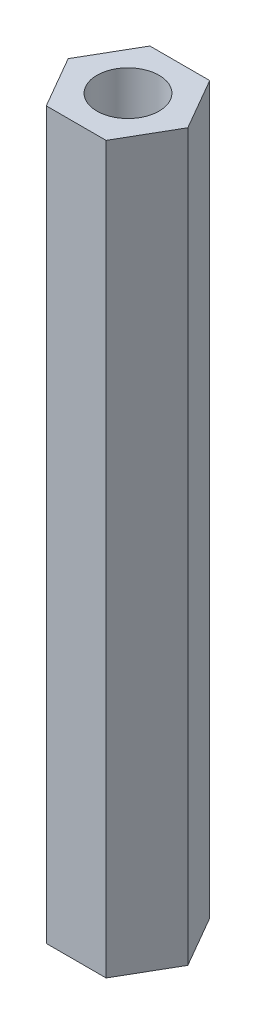
ISO-10303-21;
HEADER;
FILE_DESCRIPTION(('STEP AP214'),'2;1');
FILE_NAME('part.step','',(''),(''),'','','');
FILE_SCHEMA(('AUTOMOTIVE_DESIGN { 1 0 10303 214 1 1 1 1 }'));
ENDSEC;
DATA;
#1=APPLICATION_CONTEXT('core data for automotive mechanical design processes');
#2=APPLICATION_PROTOCOL_DEFINITION('international standard','automotive_design',2000,#1);
#3=PRODUCT_CONTEXT('',#1,'mechanical');
#4=PRODUCT('Part','Part','',(#3));
#5=PRODUCT_RELATED_PRODUCT_CATEGORY('part','',(#4));
#6=PRODUCT_DEFINITION_FORMATION('','',#4);
#7=PRODUCT_DEFINITION_CONTEXT('part definition',#1,'design');
#8=PRODUCT_DEFINITION('design','',#6,#7);
#9=PRODUCT_DEFINITION_SHAPE('','',#8);
#10=(LENGTH_UNIT() NAMED_UNIT(*) SI_UNIT(.MILLI.,.METRE.));
#11=(NAMED_UNIT(*) PLANE_ANGLE_UNIT() SI_UNIT($,.RADIAN.));
#12=(NAMED_UNIT(*) SI_UNIT($,.STERADIAN.) SOLID_ANGLE_UNIT());
#13=UNCERTAINTY_MEASURE_WITH_UNIT(LENGTH_MEASURE(1.E-05),#10,'distance_accuracy_value','');
#14=(GEOMETRIC_REPRESENTATION_CONTEXT(3) GLOBAL_UNCERTAINTY_ASSIGNED_CONTEXT((#13)) GLOBAL_UNIT_ASSIGNED_CONTEXT((#10,
#11,#12)) REPRESENTATION_CONTEXT('',''));
#15=CARTESIAN_POINT('',(0.,0.,0.));
#16=DIRECTION('',(0.,0.,1.));
#17=DIRECTION('',(1.,0.,0.));
#18=AXIS2_PLACEMENT_3D('',#15,#16,#17);
#19=CARTESIAN_POINT('',(-117.109887718177,744.292319552453,163.417570962768));
#20=DIRECTION('',(-0.866025403838329,0.,-0.499999999906659));
#21=DIRECTION('',(-0.499999999906659,0.,0.866025403838329));
#22=AXIS2_PLACEMENT_3D('',#19,#20,#21);
#23=PLANE('',#22);
#24=DIRECTION('',(0.500000000006738,0.,-0.866025403780548));
#25=VECTOR('',#24,1.);
#26=CARTESIAN_POINT('',(-117.109887718177,729.292319552453,163.417570962768));
#27=LINE('',#26,#25);
#28=CARTESIAN_POINT('',(-117.109887718177,729.292319552453,163.417570962768));
#29=VERTEX_POINT('',#28);
#30=CARTESIAN_POINT('',(-115.666512045177,729.292319552453,160.917570962768));
#31=VERTEX_POINT('',#30);
#32=EDGE_CURVE('E12',#29,#31,#27,.T.);
#33=ORIENTED_EDGE('',*,*,#32,.T.);
#34=DIRECTION('',(0.,-1.,0.));
#35=VECTOR('',#34,1.);
#36=CARTESIAN_POINT('',(-115.666512045177,744.292319552453,160.917570962768));
#37=LINE('',#36,#35);
#38=CARTESIAN_POINT('',(-115.666512045177,764.292319552453,160.917570962768));
#39=VERTEX_POINT('',#38);
#40=EDGE_CURVE('E58',#39,#31,#37,.T.);
#41=ORIENTED_EDGE('',*,*,#40,.F.);
#42=DIRECTION('',(0.500000000006738,0.,-0.866025403780549));
#43=VECTOR('',#42,1.);
#44=CARTESIAN_POINT('',(-117.109887718177,764.292319552453,163.417570962768));
#45=LINE('',#44,#43);
#46=CARTESIAN_POINT('',(-117.109887718177,764.292319552453,163.417570962768));
#47=VERTEX_POINT('',#46);
#48=EDGE_CURVE('E113',#47,#39,#45,.T.);
#49=ORIENTED_EDGE('',*,*,#48,.F.);
#50=DIRECTION('',(0.,-1.,0.));
#51=VECTOR('',#50,1.);
#52=CARTESIAN_POINT('',(-117.109887718177,744.292319552453,163.417570962768));
#53=LINE('',#52,#51);
#54=EDGE_CURVE('E49',#47,#29,#53,.T.);
#55=ORIENTED_EDGE('',*,*,#54,.T.);
#56=EDGE_LOOP('',(#33,#41,#49,#55));
#57=FACE_BOUND('',#56,.T.);
#58=ADVANCED_FACE('F38',(#57),#23,.F.);
#59=CARTESIAN_POINT('',(-115.666512045177,744.292319552453,160.917570962768));
#60=DIRECTION('',(-0.866025403838329,0.,0.499999999906659));
#61=DIRECTION('',(0.499999999906659,0.,0.866025403838329));
#62=AXIS2_PLACEMENT_3D('',#59,#60,#61);
#63=PLANE('',#62);
#64=DIRECTION('',(-0.500000000006738,0.,-0.866025403780548));
#65=VECTOR('',#64,1.);
#66=CARTESIAN_POINT('',(-115.666512045177,729.292319552453,160.917570962768));
#67=LINE('',#66,#65);
#68=CARTESIAN_POINT('',(-117.109887718177,729.292319552453,158.417570962768));
#69=VERTEX_POINT('',#68);
#70=EDGE_CURVE('E110',#31,#69,#67,.T.);
#71=ORIENTED_EDGE('',*,*,#70,.T.);
#72=DIRECTION('',(0.,-1.,0.));
#73=VECTOR('',#72,1.);
#74=CARTESIAN_POINT('',(-117.109887718177,744.292319552453,158.417570962768));
#75=LINE('',#74,#73);
#76=CARTESIAN_POINT('',(-117.109887718177,764.292319552453,158.417570962768));
#77=VERTEX_POINT('',#76);
#78=EDGE_CURVE('E73',#77,#69,#75,.T.);
#79=ORIENTED_EDGE('',*,*,#78,.F.);
#80=DIRECTION('',(-0.500000000006738,0.,-0.866025403780549));
#81=VECTOR('',#80,1.);
#82=CARTESIAN_POINT('',(-115.666512045177,764.292319552453,160.917570962768));
#83=LINE('',#82,#81);
#84=EDGE_CURVE('E116',#39,#77,#83,.T.);
#85=ORIENTED_EDGE('',*,*,#84,.F.);
#86=ORIENTED_EDGE('',*,*,#40,.T.);
#87=EDGE_LOOP('',(#71,#79,#85,#86));
#88=FACE_BOUND('',#87,.T.);
#89=ADVANCED_FACE('F186',(#88),#63,.F.);
#90=CARTESIAN_POINT('',(-117.109887718177,744.292319552453,158.417570962768));
#91=DIRECTION('',(0.,0.,1.));
#92=DIRECTION('',(1.,0.,0.));
#93=AXIS2_PLACEMENT_3D('',#90,#91,#92);
#94=PLANE('',#93);
#95=DIRECTION('',(-1.,0.,0.));
#96=VECTOR('',#95,1.);
#97=CARTESIAN_POINT('',(-117.109887718177,729.292319552453,158.417570962768));
#98=LINE('',#97,#96);
#99=CARTESIAN_POINT('',(-119.996639064177,729.292319552453,158.417570962768));
#100=VERTEX_POINT('',#99);
#101=EDGE_CURVE('E151',#69,#100,#98,.T.);
#102=ORIENTED_EDGE('',*,*,#101,.T.);
#103=DIRECTION('',(0.,-1.,0.));
#104=VECTOR('',#103,1.);
#105=CARTESIAN_POINT('',(-119.996639064177,744.292319552453,158.417570962768));
#106=LINE('',#105,#104);
#107=CARTESIAN_POINT('',(-119.996639064177,764.292319552453,158.417570962768));
#108=VERTEX_POINT('',#107);
#109=EDGE_CURVE('E79',#108,#100,#106,.T.);
#110=ORIENTED_EDGE('',*,*,#109,.F.);
#111=DIRECTION('',(-1.,0.,0.));
#112=VECTOR('',#111,1.);
#113=CARTESIAN_POINT('',(-117.109887718177,764.292319552453,158.417570962768));
#114=LINE('',#113,#112);
#115=EDGE_CURVE('E130',#77,#108,#114,.T.);
#116=ORIENTED_EDGE('',*,*,#115,.F.);
#117=ORIENTED_EDGE('',*,*,#78,.T.);
#118=EDGE_LOOP('',(#102,#110,#116,#117));
#119=FACE_BOUND('',#118,.T.);
#120=ADVANCED_FACE('F187',(#119),#94,.F.);
#121=CARTESIAN_POINT('',(-119.996639064177,744.292319552453,158.417570962768));
#122=DIRECTION('',(0.866025403838329,0.,0.499999999906659));
#123=DIRECTION('',(0.499999999906659,0.,-0.866025403838329));
#124=AXIS2_PLACEMENT_3D('',#121,#122,#123);
#125=PLANE('',#124);
#126=DIRECTION('',(-0.500000000006738,0.,0.866025403780548));
#127=VECTOR('',#126,1.);
#128=CARTESIAN_POINT('',(-119.996639064177,729.292319552453,158.417570962768));
#129=LINE('',#128,#127);
#130=CARTESIAN_POINT('',(-121.440014737177,729.292319552453,160.917570962768));
#131=VERTEX_POINT('',#130);
#132=EDGE_CURVE('E42',#100,#131,#129,.T.);
#133=ORIENTED_EDGE('',*,*,#132,.T.);
#134=DIRECTION('',(0.,-1.,0.));
#135=VECTOR('',#134,1.);
#136=CARTESIAN_POINT('',(-121.440014737177,744.292319552453,160.917570962768));
#137=LINE('',#136,#135);
#138=CARTESIAN_POINT('',(-121.440014737177,764.292319552453,160.917570962768));
#139=VERTEX_POINT('',#138);
#140=EDGE_CURVE('E85',#139,#131,#137,.T.);
#141=ORIENTED_EDGE('',*,*,#140,.F.);
#142=DIRECTION('',(-0.500000000006738,0.,0.866025403780549));
#143=VECTOR('',#142,1.);
#144=CARTESIAN_POINT('',(-119.996639064177,764.292319552453,158.417570962768));
#145=LINE('',#144,#143);
#146=EDGE_CURVE('E133',#108,#139,#145,.T.);
#147=ORIENTED_EDGE('',*,*,#146,.F.);
#148=ORIENTED_EDGE('',*,*,#109,.T.);
#149=EDGE_LOOP('',(#133,#141,#147,#148));
#150=FACE_BOUND('',#149,.T.);
#151=ADVANCED_FACE('F188',(#150),#125,.F.);
#152=CARTESIAN_POINT('',(-121.440014737177,744.292319552453,160.917570962768));
#153=DIRECTION('',(0.866025403838329,0.,-0.499999999906659));
#154=DIRECTION('',(-0.499999999906659,0.,-0.866025403838329));
#155=AXIS2_PLACEMENT_3D('',#152,#153,#154);
#156=PLANE('',#155);
#157=DIRECTION('',(0.500000000006738,0.,0.866025403780548));
#158=VECTOR('',#157,1.);
#159=CARTESIAN_POINT('',(-121.440014737177,729.292319552453,160.917570962768));
#160=LINE('',#159,#158);
#161=CARTESIAN_POINT('',(-119.996639064177,729.292319552453,163.417570962768));
#162=VERTEX_POINT('',#161);
#163=EDGE_CURVE('E153',#131,#162,#160,.T.);
#164=ORIENTED_EDGE('',*,*,#163,.T.);
#165=DIRECTION('',(0.,-1.,0.));
#166=VECTOR('',#165,1.);
#167=CARTESIAN_POINT('',(-119.996639064177,744.292319552453,163.417570962768));
#168=LINE('',#167,#166);
#169=CARTESIAN_POINT('',(-119.996639064177,764.292319552453,163.417570962768));
#170=VERTEX_POINT('',#169);
#171=EDGE_CURVE('E135',#170,#162,#168,.T.);
#172=ORIENTED_EDGE('',*,*,#171,.F.);
#173=DIRECTION('',(0.500000000006738,0.,0.866025403780549));
#174=VECTOR('',#173,1.);
#175=CARTESIAN_POINT('',(-121.440014737177,764.292319552453,160.917570962768));
#176=LINE('',#175,#174);
#177=EDGE_CURVE('E121',#139,#170,#176,.T.);
#178=ORIENTED_EDGE('',*,*,#177,.F.);
#179=ORIENTED_EDGE('',*,*,#140,.T.);
#180=EDGE_LOOP('',(#164,#172,#178,#179));
#181=FACE_BOUND('',#180,.T.);
#182=ADVANCED_FACE('F181',(#181),#156,.F.);
#183=CARTESIAN_POINT('',(-119.996639064177,744.292319552453,163.417570962768));
#184=DIRECTION('',(0.,0.,-1.));
#185=DIRECTION('',(-1.,0.,0.));
#186=AXIS2_PLACEMENT_3D('',#183,#184,#185);
#187=PLANE('',#186);
#188=DIRECTION('',(1.,0.,0.));
#189=VECTOR('',#188,1.);
#190=CARTESIAN_POINT('',(-119.996639064177,729.292319552453,163.417570962768));
#191=LINE('',#190,#189);
#192=EDGE_CURVE('E107',#162,#29,#191,.T.);
#193=ORIENTED_EDGE('',*,*,#192,.T.);
#194=ORIENTED_EDGE('',*,*,#54,.F.);
#195=DIRECTION('',(1.,0.,0.));
#196=VECTOR('',#195,1.);
#197=CARTESIAN_POINT('',(-119.996639064177,764.292319552453,163.417570962768));
#198=LINE('',#197,#196);
#199=EDGE_CURVE('E105',#170,#47,#198,.T.);
#200=ORIENTED_EDGE('',*,*,#199,.F.);
#201=ORIENTED_EDGE('',*,*,#171,.T.);
#202=EDGE_LOOP('',(#193,#194,#200,#201));
#203=FACE_BOUND('',#202,.T.);
#204=ADVANCED_FACE('F103',(#203),#187,.F.);
#205=CARTESIAN_POINT('',(-118.553263391177,729.292319552453,160.917570962768));
#206=DIRECTION('',(0.,1.,0.));
#207=DIRECTION('',(0.,0.,1.));
#208=AXIS2_PLACEMENT_3D('',#205,#206,#207);
#209=PLANE('',#208);
#210=CARTESIAN_POINT('',(-118.553263391177,729.292319552453,160.917570962768));
#211=DIRECTION('',(0.,1.,0.));
#212=DIRECTION('',(0.,0.,1.));
#213=AXIS2_PLACEMENT_3D('',#210,#211,#212);
#214=CIRCLE('',#213,1.5);
#215=CARTESIAN_POINT('',(-118.553263391177,729.292319552453,162.417570962768));
#216=VERTEX_POINT('',#215);
#217=EDGE_CURVE('E122',#216,#216,#214,.F.);
#218=ORIENTED_EDGE('',*,*,#217,.F.);
#219=EDGE_LOOP('',(#218));
#220=FACE_BOUND('',#219,.T.);
#221=ORIENTED_EDGE('',*,*,#32,.F.);
#222=ORIENTED_EDGE('',*,*,#192,.F.);
#223=ORIENTED_EDGE('',*,*,#163,.F.);
#224=ORIENTED_EDGE('',*,*,#132,.F.);
#225=ORIENTED_EDGE('',*,*,#101,.F.);
#226=ORIENTED_EDGE('',*,*,#70,.F.);
#227=EDGE_LOOP('',(#221,#222,#223,#224,#225,#226));
#228=FACE_BOUND('',#227,.T.);
#229=ADVANCED_FACE('F40',(#220,#228),#209,.F.);
#230=CARTESIAN_POINT('',(0.,764.292319552453,0.));
#231=DIRECTION('',(0.,1.,0.));
#232=DIRECTION('',(0.,0.,1.));
#233=AXIS2_PLACEMENT_3D('',#230,#231,#232);
#234=PLANE('',#233);
#235=CARTESIAN_POINT('',(-118.553263391177,764.292319552453,160.917570962768));
#236=DIRECTION('',(0.,1.,0.));
#237=DIRECTION('',(0.,0.,1.));
#238=AXIS2_PLACEMENT_3D('',#235,#236,#237);
#239=CIRCLE('',#238,1.5);
#240=CARTESIAN_POINT('',(-118.553263391177,764.292319552453,162.417570962768));
#241=VERTEX_POINT('',#240);
#242=EDGE_CURVE('E125',#241,#241,#239,.T.);
#243=ORIENTED_EDGE('',*,*,#242,.F.);
#244=EDGE_LOOP('',(#243));
#245=FACE_BOUND('',#244,.T.);
#246=ORIENTED_EDGE('',*,*,#199,.T.);
#247=ORIENTED_EDGE('',*,*,#48,.T.);
#248=ORIENTED_EDGE('',*,*,#84,.T.);
#249=ORIENTED_EDGE('',*,*,#115,.T.);
#250=ORIENTED_EDGE('',*,*,#146,.T.);
#251=ORIENTED_EDGE('',*,*,#177,.T.);
#252=EDGE_LOOP('',(#246,#247,#248,#249,#250,#251));
#253=FACE_BOUND('',#252,.T.);
#254=ADVANCED_FACE('F119',(#245,#253),#234,.T.);
#255=CARTESIAN_POINT('',(-118.553263391177,725.049678865334,160.917570962768));
#256=DIRECTION('',(0.,1.,0.));
#257=DIRECTION('',(0.,0.,1.));
#258=AXIS2_PLACEMENT_3D('',#255,#256,#257);
#259=CYLINDRICAL_SURFACE('',#258,1.5);
#260=ORIENTED_EDGE('',*,*,#217,.T.);
#261=EDGE_LOOP('',(#260));
#262=FACE_BOUND('',#261,.T.);
#263=ORIENTED_EDGE('',*,*,#242,.T.);
#264=EDGE_LOOP('',(#263));
#265=FACE_BOUND('',#264,.T.);
#266=ADVANCED_FACE('F211',(#262,#265),#259,.F.);
#267=CLOSED_SHELL('',(#58,#89,#120,#151,#182,#204,#229,#254,#266));
#268=MANIFOLD_SOLID_BREP('B2',#267);
#269=ADVANCED_BREP_SHAPE_REPRESENTATION('',(#18,#268),#14);
#270=SHAPE_DEFINITION_REPRESENTATION(#9,#269);
ENDSEC;
END-ISO-10303-21;
